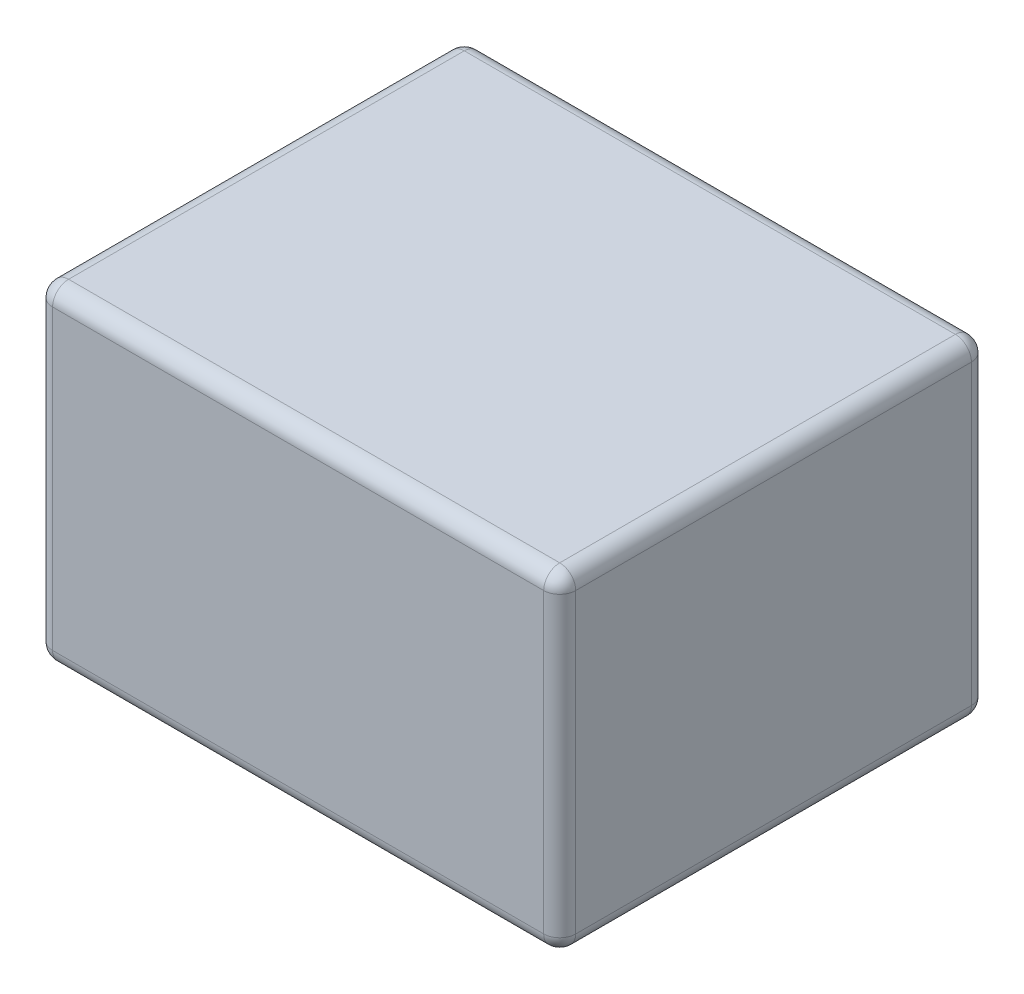
ISO-10303-21;
HEADER;
FILE_DESCRIPTION(('STEP AP214'),'2;1');
FILE_NAME('part.step','',(''),(''),'','','');
FILE_SCHEMA(('AUTOMOTIVE_DESIGN { 1 0 10303 214 1 1 1 1 }'));
ENDSEC;
DATA;
#1=APPLICATION_CONTEXT('core data for automotive mechanical design processes');
#2=APPLICATION_PROTOCOL_DEFINITION('international standard','automotive_design',2000,#1);
#3=PRODUCT_CONTEXT('',#1,'mechanical');
#4=PRODUCT('Part','Part','',(#3));
#5=PRODUCT_RELATED_PRODUCT_CATEGORY('part','',(#4));
#6=PRODUCT_DEFINITION_FORMATION('','',#4);
#7=PRODUCT_DEFINITION_CONTEXT('part definition',#1,'design');
#8=PRODUCT_DEFINITION('design','',#6,#7);
#9=PRODUCT_DEFINITION_SHAPE('','',#8);
#10=(LENGTH_UNIT() NAMED_UNIT(*) SI_UNIT(.MILLI.,.METRE.));
#11=(NAMED_UNIT(*) PLANE_ANGLE_UNIT() SI_UNIT($,.RADIAN.));
#12=(NAMED_UNIT(*) SI_UNIT($,.STERADIAN.) SOLID_ANGLE_UNIT());
#13=UNCERTAINTY_MEASURE_WITH_UNIT(LENGTH_MEASURE(1.E-05),#10,'distance_accuracy_value','');
#14=(GEOMETRIC_REPRESENTATION_CONTEXT(3) GLOBAL_UNCERTAINTY_ASSIGNED_CONTEXT((#13)) GLOBAL_UNIT_ASSIGNED_CONTEXT((#10,
#11,#12)) REPRESENTATION_CONTEXT('',''));
#15=CARTESIAN_POINT('',(0.,0.,0.));
#16=DIRECTION('',(0.,0.,1.));
#17=DIRECTION('',(1.,0.,0.));
#18=AXIS2_PLACEMENT_3D('',#15,#16,#17);
#19=CARTESIAN_POINT('',(-95.9094761980636,12.7331197579881,44.1688603023946));
#20=DIRECTION('',(0.,1.,0.));
#21=DIRECTION('',(0.,0.,-1.));
#22=AXIS2_PLACEMENT_3D('',#19,#20,#21);
#23=CYLINDRICAL_SURFACE('',#22,0.101);
#24=CARTESIAN_POINT('',(-95.9094761980636,12.6321197579881,44.1688603023946));
#25=DIRECTION('',(0.,-1.,0.));
#26=DIRECTION('',(0.,0.,1.));
#27=AXIS2_PLACEMENT_3D('',#24,#25,#26);
#28=CIRCLE('',#27,0.101);
#29=CARTESIAN_POINT('',(-95.8084761980636,12.6321197579881,44.1688603023946));
#30=VERTEX_POINT('',#29);
#31=CARTESIAN_POINT('',(-95.9094761980636,12.6321197579881,44.2698603023946));
#32=VERTEX_POINT('',#31);
#33=EDGE_CURVE('E25',#30,#32,#28,.T.);
#34=ORIENTED_EDGE('',*,*,#33,.T.);
#35=DIRECTION('',(0.,1.,0.));
#36=VECTOR('',#35,1.);
#37=CARTESIAN_POINT('',(-95.9094761980636,12.7331197579881,44.2698603023946));
#38=LINE('',#37,#36);
#39=CARTESIAN_POINT('',(-95.9094761980636,10.7561197579881,44.2698603023946));
#40=VERTEX_POINT('',#39);
#41=EDGE_CURVE('E306',#40,#32,#38,.T.);
#42=ORIENTED_EDGE('',*,*,#41,.F.);
#43=CARTESIAN_POINT('',(-95.9094761980636,10.7561197579881,44.1688603023946));
#44=DIRECTION('',(0.,1.,0.));
#45=DIRECTION('',(0.,0.,-1.));
#46=AXIS2_PLACEMENT_3D('',#43,#44,#45);
#47=CIRCLE('',#46,0.101);
#48=CARTESIAN_POINT('',(-95.8084761980636,10.7561197579881,44.1688603023946));
#49=VERTEX_POINT('',#48);
#50=EDGE_CURVE('E11',#40,#49,#47,.T.);
#51=ORIENTED_EDGE('',*,*,#50,.T.);
#52=DIRECTION('',(0.,-1.,0.));
#53=VECTOR('',#52,1.);
#54=CARTESIAN_POINT('',(-95.8084761980636,12.7331197579881,44.1688603023946));
#55=LINE('',#54,#53);
#56=EDGE_CURVE('E199',#30,#49,#55,.T.);
#57=ORIENTED_EDGE('',*,*,#56,.F.);
#58=EDGE_LOOP('',(#34,#42,#51,#57));
#59=FACE_BOUND('',#58,.T.);
#60=ADVANCED_FACE('F17',(#59),#23,.T.);
#61=CARTESIAN_POINT('',(-95.9094761980636,10.7561197579881,44.1688603023946));
#62=DIRECTION('',(0.,1.,0.));
#63=DIRECTION('',(1.,0.,0.));
#64=AXIS2_PLACEMENT_3D('',#61,#62,#63);
#65=SPHERICAL_SURFACE('',#64,0.101);
#66=CARTESIAN_POINT('',(-95.9094761980636,10.7561197579881,44.1688603023946));
#67=DIRECTION('',(1.,0.,0.));
#68=DIRECTION('',(0.,0.,-1.));
#69=AXIS2_PLACEMENT_3D('',#66,#67,#68);
#70=CIRCLE('',#69,0.101);
#71=CARTESIAN_POINT('',(-95.9094761980636,10.6551197579881,44.1688603023946));
#72=VERTEX_POINT('',#71);
#73=EDGE_CURVE('E297',#40,#72,#70,.T.);
#74=ORIENTED_EDGE('',*,*,#73,.T.);
#75=CARTESIAN_POINT('',(-95.9094761980636,10.7561197579881,44.1688603023946));
#76=DIRECTION('',(0.,0.,1.));
#77=DIRECTION('',(1.,0.,0.));
#78=AXIS2_PLACEMENT_3D('',#75,#76,#77);
#79=CIRCLE('',#78,0.101);
#80=EDGE_CURVE('E293',#72,#49,#79,.T.);
#81=ORIENTED_EDGE('',*,*,#80,.T.);
#82=ORIENTED_EDGE('',*,*,#50,.F.);
#83=EDGE_LOOP('',(#74,#81,#82));
#84=FACE_BOUND('',#83,.T.);
#85=ADVANCED_FACE('F400',(#84),#65,.T.);
#86=CARTESIAN_POINT('',(-95.9094761980636,12.6321197579881,44.1688603023946));
#87=DIRECTION('',(0.,1.,0.));
#88=DIRECTION('',(1.,0.,0.));
#89=AXIS2_PLACEMENT_3D('',#86,#87,#88);
#90=SPHERICAL_SURFACE('',#89,0.101);
#91=CARTESIAN_POINT('',(-95.9094761980636,12.6321197579881,44.1688603023946));
#92=DIRECTION('',(0.,0.,1.));
#93=DIRECTION('',(1.,0.,0.));
#94=AXIS2_PLACEMENT_3D('',#91,#92,#93);
#95=CIRCLE('',#94,0.101);
#96=CARTESIAN_POINT('',(-95.9094761980636,12.7331197579881,44.1688603023946));
#97=VERTEX_POINT('',#96);
#98=EDGE_CURVE('E290',#30,#97,#95,.T.);
#99=ORIENTED_EDGE('',*,*,#98,.T.);
#100=CARTESIAN_POINT('',(-95.9094761980636,12.6321197579881,44.1688603023946));
#101=DIRECTION('',(1.,0.,0.));
#102=DIRECTION('',(0.,0.,-1.));
#103=AXIS2_PLACEMENT_3D('',#100,#101,#102);
#104=CIRCLE('',#103,0.101);
#105=EDGE_CURVE('E202',#97,#32,#104,.T.);
#106=ORIENTED_EDGE('',*,*,#105,.T.);
#107=ORIENTED_EDGE('',*,*,#33,.F.);
#108=EDGE_LOOP('',(#99,#106,#107));
#109=FACE_BOUND('',#108,.T.);
#110=ADVANCED_FACE('F314',(#109),#90,.T.);
#111=CARTESIAN_POINT('',(-99.1084761980636,10.7561197579881,44.1688603023946));
#112=DIRECTION('',(-1.,0.,0.));
#113=DIRECTION('',(0.,0.,-1.));
#114=AXIS2_PLACEMENT_3D('',#111,#112,#113);
#115=CYLINDRICAL_SURFACE('',#114,0.101);
#116=CARTESIAN_POINT('',(-99.0074761980636,10.7561197579881,44.1688603023946));
#117=DIRECTION('',(1.,0.,0.));
#118=DIRECTION('',(0.,0.,1.));
#119=AXIS2_PLACEMENT_3D('',#116,#117,#118);
#120=CIRCLE('',#119,0.101);
#121=CARTESIAN_POINT('',(-99.0074761980636,10.7561197579881,44.2698603023946));
#122=VERTEX_POINT('',#121);
#123=CARTESIAN_POINT('',(-99.0074761980636,10.6551197579881,44.1688603023946));
#124=VERTEX_POINT('',#123);
#125=EDGE_CURVE('E49',#122,#124,#120,.T.);
#126=ORIENTED_EDGE('',*,*,#125,.T.);
#127=DIRECTION('',(-1.,0.,0.));
#128=VECTOR('',#127,1.);
#129=CARTESIAN_POINT('',(-99.1084761980636,10.6551197579881,44.1688603023946));
#130=LINE('',#129,#128);
#131=EDGE_CURVE('E240',#72,#124,#130,.T.);
#132=ORIENTED_EDGE('',*,*,#131,.F.);
#133=ORIENTED_EDGE('',*,*,#73,.F.);
#134=DIRECTION('',(1.,0.,0.));
#135=VECTOR('',#134,1.);
#136=CARTESIAN_POINT('',(-99.1084761980636,10.7561197579881,44.2698603023946));
#137=LINE('',#136,#135);
#138=EDGE_CURVE('E326',#122,#40,#137,.T.);
#139=ORIENTED_EDGE('',*,*,#138,.F.);
#140=EDGE_LOOP('',(#126,#132,#133,#139));
#141=FACE_BOUND('',#140,.T.);
#142=ADVANCED_FACE('F409',(#141),#115,.T.);
#143=CARTESIAN_POINT('',(-95.9094761980636,10.7561197579881,44.2698603023946));
#144=DIRECTION('',(0.,0.,1.));
#145=DIRECTION('',(-1.,0.,0.));
#146=AXIS2_PLACEMENT_3D('',#143,#144,#145);
#147=CYLINDRICAL_SURFACE('',#146,0.101);
#148=CARTESIAN_POINT('',(-95.9094761980636,10.7561197579881,41.6728603023946));
#149=DIRECTION('',(0.,0.,1.));
#150=DIRECTION('',(-1.,0.,0.));
#151=AXIS2_PLACEMENT_3D('',#148,#149,#150);
#152=CIRCLE('',#151,0.101);
#153=CARTESIAN_POINT('',(-95.9094761980636,10.6551197579881,41.6728603023946));
#154=VERTEX_POINT('',#153);
#155=CARTESIAN_POINT('',(-95.8084761980636,10.7561197579881,41.6728603023946));
#156=VERTEX_POINT('',#155);
#157=EDGE_CURVE('E203',#154,#156,#152,.T.);
#158=ORIENTED_EDGE('',*,*,#157,.T.);
#159=DIRECTION('',(0.,0.,-1.));
#160=VECTOR('',#159,1.);
#161=CARTESIAN_POINT('',(-95.8084761980636,10.7561197579881,44.2698603023946));
#162=LINE('',#161,#160);
#163=EDGE_CURVE('E195',#49,#156,#162,.T.);
#164=ORIENTED_EDGE('',*,*,#163,.F.);
#165=ORIENTED_EDGE('',*,*,#80,.F.);
#166=DIRECTION('',(0.,0.,1.));
#167=VECTOR('',#166,1.);
#168=CARTESIAN_POINT('',(-95.9094761980636,10.6551197579881,44.2698603023946));
#169=LINE('',#168,#167);
#170=EDGE_CURVE('E236',#154,#72,#169,.T.);
#171=ORIENTED_EDGE('',*,*,#170,.F.);
#172=EDGE_LOOP('',(#158,#164,#165,#171));
#173=FACE_BOUND('',#172,.T.);
#174=ADVANCED_FACE('F360',(#173),#147,.T.);
#175=CARTESIAN_POINT('',(-95.9094761980636,12.6321197579881,44.2698603023946));
#176=DIRECTION('',(0.,0.,-1.));
#177=DIRECTION('',(1.,0.,0.));
#178=AXIS2_PLACEMENT_3D('',#175,#176,#177);
#179=CYLINDRICAL_SURFACE('',#178,0.101);
#180=CARTESIAN_POINT('',(-95.9094761980636,12.6321197579881,41.6728603023946));
#181=DIRECTION('',(0.,0.,1.));
#182=DIRECTION('',(-1.,0.,0.));
#183=AXIS2_PLACEMENT_3D('',#180,#181,#182);
#184=CIRCLE('',#183,0.101);
#185=CARTESIAN_POINT('',(-95.8084761980636,12.6321197579881,41.6728603023946));
#186=VERTEX_POINT('',#185);
#187=CARTESIAN_POINT('',(-95.9094761980636,12.7331197579881,41.6728603023946));
#188=VERTEX_POINT('',#187);
#189=EDGE_CURVE('E284',#186,#188,#184,.T.);
#190=ORIENTED_EDGE('',*,*,#189,.T.);
#191=DIRECTION('',(0.,0.,-1.));
#192=VECTOR('',#191,1.);
#193=CARTESIAN_POINT('',(-95.9094761980636,12.7331197579881,41.5718603023946));
#194=LINE('',#193,#192);
#195=EDGE_CURVE('E211',#97,#188,#194,.T.);
#196=ORIENTED_EDGE('',*,*,#195,.F.);
#197=ORIENTED_EDGE('',*,*,#98,.F.);
#198=DIRECTION('',(0.,0.,1.));
#199=VECTOR('',#198,1.);
#200=CARTESIAN_POINT('',(-95.8084761980636,12.6321197579881,44.2698603023946));
#201=LINE('',#200,#199);
#202=EDGE_CURVE('E190',#186,#30,#201,.T.);
#203=ORIENTED_EDGE('',*,*,#202,.F.);
#204=EDGE_LOOP('',(#190,#196,#197,#203));
#205=FACE_BOUND('',#204,.T.);
#206=ADVANCED_FACE('F346',(#205),#179,.T.);
#207=CARTESIAN_POINT('',(-99.1084761980636,12.6321197579881,44.1688603023946));
#208=DIRECTION('',(1.,0.,0.));
#209=DIRECTION('',(0.,0.,1.));
#210=AXIS2_PLACEMENT_3D('',#207,#208,#209);
#211=CYLINDRICAL_SURFACE('',#210,0.101);
#212=CARTESIAN_POINT('',(-99.0074761980636,12.6321197579881,44.1688603023946));
#213=DIRECTION('',(1.,0.,0.));
#214=DIRECTION('',(0.,0.,1.));
#215=AXIS2_PLACEMENT_3D('',#212,#213,#214);
#216=CIRCLE('',#215,0.101);
#217=CARTESIAN_POINT('',(-99.0074761980636,12.7331197579881,44.1688603023946));
#218=VERTEX_POINT('',#217);
#219=CARTESIAN_POINT('',(-99.0074761980636,12.6321197579881,44.2698603023946));
#220=VERTEX_POINT('',#219);
#221=EDGE_CURVE('E226',#218,#220,#216,.T.);
#222=ORIENTED_EDGE('',*,*,#221,.T.);
#223=DIRECTION('',(-1.,0.,0.));
#224=VECTOR('',#223,1.);
#225=CARTESIAN_POINT('',(-99.1084761980636,12.6321197579881,44.2698603023946));
#226=LINE('',#225,#224);
#227=EDGE_CURVE('E319',#32,#220,#226,.T.);
#228=ORIENTED_EDGE('',*,*,#227,.F.);
#229=ORIENTED_EDGE('',*,*,#105,.F.);
#230=DIRECTION('',(1.,0.,0.));
#231=VECTOR('',#230,1.);
#232=CARTESIAN_POINT('',(-95.8084761980636,12.7331197579881,44.1688603023946));
#233=LINE('',#232,#231);
#234=EDGE_CURVE('E207',#218,#97,#233,.T.);
#235=ORIENTED_EDGE('',*,*,#234,.F.);
#236=EDGE_LOOP('',(#222,#228,#229,#235));
#237=FACE_BOUND('',#236,.T.);
#238=ADVANCED_FACE('F320',(#237),#211,.T.);
#239=CARTESIAN_POINT('',(-99.0074761980636,10.7561197579881,44.1688603023946));
#240=DIRECTION('',(0.,1.,0.));
#241=DIRECTION('',(1.,0.,0.));
#242=AXIS2_PLACEMENT_3D('',#239,#240,#241);
#243=SPHERICAL_SURFACE('',#242,0.101);
#244=CARTESIAN_POINT('',(-99.0074761980636,10.7561197579881,44.1688603023946));
#245=DIRECTION('',(0.,-1.,0.));
#246=DIRECTION('',(1.,0.,0.));
#247=AXIS2_PLACEMENT_3D('',#244,#245,#246);
#248=CIRCLE('',#247,0.101);
#249=CARTESIAN_POINT('',(-99.1084761980636,10.7561197579881,44.1688603023946));
#250=VERTEX_POINT('',#249);
#251=EDGE_CURVE('E223',#122,#250,#248,.T.);
#252=ORIENTED_EDGE('',*,*,#251,.T.);
#253=CARTESIAN_POINT('',(-99.0074761980636,10.7561197579881,44.1688603023946));
#254=DIRECTION('',(0.,0.,1.));
#255=DIRECTION('',(1.,0.,0.));
#256=AXIS2_PLACEMENT_3D('',#253,#254,#255);
#257=CIRCLE('',#256,0.101);
#258=EDGE_CURVE('E248',#250,#124,#257,.T.);
#259=ORIENTED_EDGE('',*,*,#258,.T.);
#260=ORIENTED_EDGE('',*,*,#125,.F.);
#261=EDGE_LOOP('',(#252,#259,#260));
#262=FACE_BOUND('',#261,.T.);
#263=ADVANCED_FACE('F418',(#262),#243,.T.);
#264=CARTESIAN_POINT('',(-95.9094761980636,10.7561197579881,41.6728603023946));
#265=DIRECTION('',(0.,1.,0.));
#266=DIRECTION('',(1.,0.,0.));
#267=AXIS2_PLACEMENT_3D('',#264,#265,#266);
#268=SPHERICAL_SURFACE('',#267,0.101);
#269=CARTESIAN_POINT('',(-95.9094761980636,10.7561197579881,41.6728603023946));
#270=DIRECTION('',(1.,0.,0.));
#271=DIRECTION('',(0.,0.,-1.));
#272=AXIS2_PLACEMENT_3D('',#269,#270,#271);
#273=CIRCLE('',#272,0.101);
#274=CARTESIAN_POINT('',(-95.9094761980636,10.7561197579881,41.5718603023946));
#275=VERTEX_POINT('',#274);
#276=EDGE_CURVE('E245',#154,#275,#273,.T.);
#277=ORIENTED_EDGE('',*,*,#276,.T.);
#278=CARTESIAN_POINT('',(-95.9094761980636,10.7561197579881,41.6728603023946));
#279=DIRECTION('',(0.,-1.,0.));
#280=DIRECTION('',(1.,0.,0.));
#281=AXIS2_PLACEMENT_3D('',#278,#279,#280);
#282=CIRCLE('',#281,0.101);
#283=EDGE_CURVE('E271',#275,#156,#282,.T.);
#284=ORIENTED_EDGE('',*,*,#283,.T.);
#285=ORIENTED_EDGE('',*,*,#157,.F.);
#286=EDGE_LOOP('',(#277,#284,#285));
#287=FACE_BOUND('',#286,.T.);
#288=ADVANCED_FACE('F366',(#287),#268,.T.);
#289=CARTESIAN_POINT('',(-95.9094761980636,12.6321197579881,41.6728603023946));
#290=DIRECTION('',(0.,1.,0.));
#291=DIRECTION('',(1.,0.,0.));
#292=AXIS2_PLACEMENT_3D('',#289,#290,#291);
#293=SPHERICAL_SURFACE('',#292,0.101);
#294=CARTESIAN_POINT('',(-95.9094761980636,12.6321197579881,41.6728603023946));
#295=DIRECTION('',(0.,1.,0.));
#296=DIRECTION('',(0.,0.,1.));
#297=AXIS2_PLACEMENT_3D('',#294,#295,#296);
#298=CIRCLE('',#297,0.101);
#299=CARTESIAN_POINT('',(-95.9094761980636,12.6321197579881,41.5718603023946));
#300=VERTEX_POINT('',#299);
#301=EDGE_CURVE('E249',#186,#300,#298,.T.);
#302=ORIENTED_EDGE('',*,*,#301,.T.);
#303=CARTESIAN_POINT('',(-95.9094761980636,12.6321197579881,41.6728603023946));
#304=DIRECTION('',(1.,0.,0.));
#305=DIRECTION('',(0.,0.,-1.));
#306=AXIS2_PLACEMENT_3D('',#303,#304,#305);
#307=CIRCLE('',#306,0.101);
#308=EDGE_CURVE('E170',#300,#188,#307,.T.);
#309=ORIENTED_EDGE('',*,*,#308,.T.);
#310=ORIENTED_EDGE('',*,*,#189,.F.);
#311=EDGE_LOOP('',(#302,#309,#310));
#312=FACE_BOUND('',#311,.T.);
#313=ADVANCED_FACE('F350',(#312),#293,.T.);
#314=CARTESIAN_POINT('',(-99.0074761980636,12.6321197579881,44.1688603023946));
#315=DIRECTION('',(0.,1.,0.));
#316=DIRECTION('',(1.,0.,0.));
#317=AXIS2_PLACEMENT_3D('',#314,#315,#316);
#318=SPHERICAL_SURFACE('',#317,0.101);
#319=CARTESIAN_POINT('',(-99.0074761980636,12.6321197579881,44.1688603023946));
#320=DIRECTION('',(0.,0.,1.));
#321=DIRECTION('',(1.,0.,0.));
#322=AXIS2_PLACEMENT_3D('',#319,#320,#321);
#323=CIRCLE('',#322,0.101);
#324=CARTESIAN_POINT('',(-99.1084761980636,12.6321197579881,44.1688603023946));
#325=VERTEX_POINT('',#324);
#326=EDGE_CURVE('E255',#218,#325,#323,.T.);
#327=ORIENTED_EDGE('',*,*,#326,.T.);
#328=CARTESIAN_POINT('',(-99.0074761980636,12.6321197579881,44.1688603023946));
#329=DIRECTION('',(0.,1.,0.));
#330=DIRECTION('',(0.,0.,1.));
#331=AXIS2_PLACEMENT_3D('',#328,#329,#330);
#332=CIRCLE('',#331,0.101);
#333=EDGE_CURVE('E227',#325,#220,#332,.T.);
#334=ORIENTED_EDGE('',*,*,#333,.T.);
#335=ORIENTED_EDGE('',*,*,#221,.F.);
#336=EDGE_LOOP('',(#327,#334,#335));
#337=FACE_BOUND('',#336,.T.);
#338=ADVANCED_FACE('F386',(#337),#318,.T.);
#339=CARTESIAN_POINT('',(-99.0074761980636,12.7331197579881,44.1688603023946));
#340=DIRECTION('',(0.,-1.,0.));
#341=DIRECTION('',(0.,0.,1.));
#342=AXIS2_PLACEMENT_3D('',#339,#340,#341);
#343=CYLINDRICAL_SURFACE('',#342,0.101);
#344=ORIENTED_EDGE('',*,*,#333,.F.);
#345=DIRECTION('',(0.,1.,0.));
#346=VECTOR('',#345,1.);
#347=CARTESIAN_POINT('',(-99.1084761980636,12.7331197579881,44.1688603023946));
#348=LINE('',#347,#346);
#349=EDGE_CURVE('E216',#250,#325,#348,.T.);
#350=ORIENTED_EDGE('',*,*,#349,.F.);
#351=ORIENTED_EDGE('',*,*,#251,.F.);
#352=DIRECTION('',(0.,-1.,0.));
#353=VECTOR('',#352,1.);
#354=CARTESIAN_POINT('',(-99.0074761980636,10.6551197579881,44.2698603023946));
#355=LINE('',#354,#353);
#356=EDGE_CURVE('E332',#220,#122,#355,.T.);
#357=ORIENTED_EDGE('',*,*,#356,.F.);
#358=EDGE_LOOP('',(#344,#350,#351,#357));
#359=FACE_BOUND('',#358,.T.);
#360=ADVANCED_FACE('F383',(#359),#343,.T.);
#361=CARTESIAN_POINT('',(-99.0074761980636,10.7561197579881,44.2698603023946));
#362=DIRECTION('',(0.,0.,-1.));
#363=DIRECTION('',(1.,0.,0.));
#364=AXIS2_PLACEMENT_3D('',#361,#362,#363);
#365=CYLINDRICAL_SURFACE('',#364,0.101);
#366=CARTESIAN_POINT('',(-99.0074761980636,10.7561197579881,41.6728603023946));
#367=DIRECTION('',(0.,0.,1.));
#368=DIRECTION('',(-1.,0.,0.));
#369=AXIS2_PLACEMENT_3D('',#366,#367,#368);
#370=CIRCLE('',#369,0.101);
#371=CARTESIAN_POINT('',(-99.1084761980636,10.7561197579881,41.6728603023946));
#372=VERTEX_POINT('',#371);
#373=CARTESIAN_POINT('',(-99.0074761980636,10.6551197579881,41.6728603023946));
#374=VERTEX_POINT('',#373);
#375=EDGE_CURVE('E264',#372,#374,#370,.T.);
#376=ORIENTED_EDGE('',*,*,#375,.T.);
#377=DIRECTION('',(0.,0.,-1.));
#378=VECTOR('',#377,1.);
#379=CARTESIAN_POINT('',(-99.0074761980636,10.6551197579881,41.5718603023946));
#380=LINE('',#379,#378);
#381=EDGE_CURVE('E244',#124,#374,#380,.T.);
#382=ORIENTED_EDGE('',*,*,#381,.F.);
#383=ORIENTED_EDGE('',*,*,#258,.F.);
#384=DIRECTION('',(0.,0.,1.));
#385=VECTOR('',#384,1.);
#386=CARTESIAN_POINT('',(-99.1084761980636,10.7561197579881,44.2698603023946));
#387=LINE('',#386,#385);
#388=EDGE_CURVE('E175',#372,#250,#387,.T.);
#389=ORIENTED_EDGE('',*,*,#388,.F.);
#390=EDGE_LOOP('',(#376,#382,#383,#389));
#391=FACE_BOUND('',#390,.T.);
#392=ADVANCED_FACE('F377',(#391),#365,.T.);
#393=CARTESIAN_POINT('',(-99.1084761980636,10.7561197579881,41.6728603023946));
#394=DIRECTION('',(1.,0.,0.));
#395=DIRECTION('',(0.,0.,1.));
#396=AXIS2_PLACEMENT_3D('',#393,#394,#395);
#397=CYLINDRICAL_SURFACE('',#396,0.101);
#398=CARTESIAN_POINT('',(-99.0074761980636,10.7561197579881,41.6728603023946));
#399=DIRECTION('',(1.,0.,0.));
#400=DIRECTION('',(0.,0.,1.));
#401=AXIS2_PLACEMENT_3D('',#398,#399,#400);
#402=CIRCLE('',#401,0.101);
#403=CARTESIAN_POINT('',(-99.0074761980636,10.7561197579881,41.5718603023946));
#404=VERTEX_POINT('',#403);
#405=EDGE_CURVE('E38',#374,#404,#402,.T.);
#406=ORIENTED_EDGE('',*,*,#405,.T.);
#407=DIRECTION('',(-1.,0.,0.));
#408=VECTOR('',#407,1.);
#409=CARTESIAN_POINT('',(-99.1084761980636,10.7561197579881,41.5718603023946));
#410=LINE('',#409,#408);
#411=EDGE_CURVE('E179',#275,#404,#410,.T.);
#412=ORIENTED_EDGE('',*,*,#411,.F.);
#413=ORIENTED_EDGE('',*,*,#276,.F.);
#414=DIRECTION('',(1.,0.,0.));
#415=VECTOR('',#414,1.);
#416=CARTESIAN_POINT('',(-95.8084761980636,10.6551197579881,41.6728603023946));
#417=LINE('',#416,#415);
#418=EDGE_CURVE('E163',#374,#154,#417,.T.);
#419=ORIENTED_EDGE('',*,*,#418,.F.);
#420=EDGE_LOOP('',(#406,#412,#413,#419));
#421=FACE_BOUND('',#420,.T.);
#422=ADVANCED_FACE('F368',(#421),#397,.T.);
#423=CARTESIAN_POINT('',(-95.9094761980636,12.7331197579881,41.6728603023946));
#424=DIRECTION('',(0.,-1.,0.));
#425=DIRECTION('',(0.,0.,1.));
#426=AXIS2_PLACEMENT_3D('',#423,#424,#425);
#427=CYLINDRICAL_SURFACE('',#426,0.101);
#428=ORIENTED_EDGE('',*,*,#283,.F.);
#429=DIRECTION('',(0.,-1.,0.));
#430=VECTOR('',#429,1.);
#431=CARTESIAN_POINT('',(-95.9094761980636,10.6551197579881,41.5718603023946));
#432=LINE('',#431,#430);
#433=EDGE_CURVE('E186',#300,#275,#432,.T.);
#434=ORIENTED_EDGE('',*,*,#433,.F.);
#435=ORIENTED_EDGE('',*,*,#301,.F.);
#436=DIRECTION('',(0.,1.,0.));
#437=VECTOR('',#436,1.);
#438=CARTESIAN_POINT('',(-95.8084761980636,12.7331197579881,41.6728603023946));
#439=LINE('',#438,#437);
#440=EDGE_CURVE('E194',#156,#186,#439,.T.);
#441=ORIENTED_EDGE('',*,*,#440,.F.);
#442=EDGE_LOOP('',(#428,#434,#435,#441));
#443=FACE_BOUND('',#442,.T.);
#444=ADVANCED_FACE('F354',(#443),#427,.T.);
#445=CARTESIAN_POINT('',(-99.1084761980636,12.6321197579881,41.6728603023946));
#446=DIRECTION('',(-1.,0.,0.));
#447=DIRECTION('',(0.,0.,-1.));
#448=AXIS2_PLACEMENT_3D('',#445,#446,#447);
#449=CYLINDRICAL_SURFACE('',#448,0.101);
#450=CARTESIAN_POINT('',(-99.0074761980636,12.6321197579881,41.6728603023946));
#451=DIRECTION('',(1.,0.,0.));
#452=DIRECTION('',(0.,0.,1.));
#453=AXIS2_PLACEMENT_3D('',#450,#451,#452);
#454=CIRCLE('',#453,0.101);
#455=CARTESIAN_POINT('',(-99.0074761980636,12.6321197579881,41.5718603023946));
#456=VERTEX_POINT('',#455);
#457=CARTESIAN_POINT('',(-99.0074761980636,12.7331197579881,41.6728603023946));
#458=VERTEX_POINT('',#457);
#459=EDGE_CURVE('E139',#456,#458,#454,.T.);
#460=ORIENTED_EDGE('',*,*,#459,.T.);
#461=DIRECTION('',(-1.,0.,0.));
#462=VECTOR('',#461,1.);
#463=CARTESIAN_POINT('',(-99.1084761980636,12.7331197579881,41.6728603023946));
#464=LINE('',#463,#462);
#465=EDGE_CURVE('E233',#188,#458,#464,.T.);
#466=ORIENTED_EDGE('',*,*,#465,.F.);
#467=ORIENTED_EDGE('',*,*,#308,.F.);
#468=DIRECTION('',(1.,0.,0.));
#469=VECTOR('',#468,1.);
#470=CARTESIAN_POINT('',(-99.1084761980636,12.6321197579881,41.5718603023946));
#471=LINE('',#470,#469);
#472=EDGE_CURVE('E167',#456,#300,#471,.T.);
#473=ORIENTED_EDGE('',*,*,#472,.F.);
#474=EDGE_LOOP('',(#460,#466,#467,#473));
#475=FACE_BOUND('',#474,.T.);
#476=ADVANCED_FACE('F168',(#475),#449,.T.);
#477=CARTESIAN_POINT('',(-99.0074761980636,12.6321197579881,44.2698603023946));
#478=DIRECTION('',(0.,0.,1.));
#479=DIRECTION('',(-1.,0.,0.));
#480=AXIS2_PLACEMENT_3D('',#477,#478,#479);
#481=CYLINDRICAL_SURFACE('',#480,0.101);
#482=CARTESIAN_POINT('',(-99.0074761980636,12.6321197579881,41.6728603023946));
#483=DIRECTION('',(0.,0.,1.));
#484=DIRECTION('',(-1.,0.,0.));
#485=AXIS2_PLACEMENT_3D('',#482,#483,#484);
#486=CIRCLE('',#485,0.101);
#487=CARTESIAN_POINT('',(-99.1084761980636,12.6321197579881,41.6728603023946));
#488=VERTEX_POINT('',#487);
#489=EDGE_CURVE('E144',#458,#488,#486,.T.);
#490=ORIENTED_EDGE('',*,*,#489,.T.);
#491=DIRECTION('',(0.,0.,-1.));
#492=VECTOR('',#491,1.);
#493=CARTESIAN_POINT('',(-99.1084761980636,12.6321197579881,44.2698603023946));
#494=LINE('',#493,#492);
#495=EDGE_CURVE('E220',#325,#488,#494,.T.);
#496=ORIENTED_EDGE('',*,*,#495,.F.);
#497=ORIENTED_EDGE('',*,*,#326,.F.);
#498=DIRECTION('',(0.,0.,1.));
#499=VECTOR('',#498,1.);
#500=CARTESIAN_POINT('',(-99.0074761980636,12.7331197579881,44.2698603023946));
#501=LINE('',#500,#499);
#502=EDGE_CURVE('E212',#458,#218,#501,.T.);
#503=ORIENTED_EDGE('',*,*,#502,.F.);
#504=EDGE_LOOP('',(#490,#496,#497,#503));
#505=FACE_BOUND('',#504,.T.);
#506=ADVANCED_FACE('F388',(#505),#481,.T.);
#507=CARTESIAN_POINT('',(-99.0074761980636,10.7561197579881,41.6728603023946));
#508=DIRECTION('',(0.,1.,0.));
#509=DIRECTION('',(1.,0.,0.));
#510=AXIS2_PLACEMENT_3D('',#507,#508,#509);
#511=SPHERICAL_SURFACE('',#510,0.101);
#512=ORIENTED_EDGE('',*,*,#375,.F.);
#513=CARTESIAN_POINT('',(-99.0074761980636,10.7561197579881,41.6728603023946));
#514=DIRECTION('',(0.,-1.,0.));
#515=DIRECTION('',(0.,0.,-1.));
#516=AXIS2_PLACEMENT_3D('',#513,#514,#515);
#517=CIRCLE('',#516,0.101);
#518=EDGE_CURVE('E150',#372,#404,#517,.T.);
#519=ORIENTED_EDGE('',*,*,#518,.T.);
#520=ORIENTED_EDGE('',*,*,#405,.F.);
#521=EDGE_LOOP('',(#512,#519,#520));
#522=FACE_BOUND('',#521,.T.);
#523=ADVANCED_FACE('F370',(#522),#511,.T.);
#524=CARTESIAN_POINT('',(-99.0074761980636,12.6321197579881,41.6728603023946));
#525=DIRECTION('',(0.,1.,0.));
#526=DIRECTION('',(1.,0.,0.));
#527=AXIS2_PLACEMENT_3D('',#524,#525,#526);
#528=SPHERICAL_SURFACE('',#527,0.101);
#529=ORIENTED_EDGE('',*,*,#459,.F.);
#530=CARTESIAN_POINT('',(-99.0074761980636,12.6321197579881,41.6728603023946));
#531=DIRECTION('',(0.,1.,0.));
#532=DIRECTION('',(0.,0.,1.));
#533=AXIS2_PLACEMENT_3D('',#530,#531,#532);
#534=CIRCLE('',#533,0.101);
#535=EDGE_CURVE('E142',#456,#488,#534,.T.);
#536=ORIENTED_EDGE('',*,*,#535,.T.);
#537=ORIENTED_EDGE('',*,*,#489,.F.);
#538=EDGE_LOOP('',(#529,#536,#537));
#539=FACE_BOUND('',#538,.T.);
#540=ADVANCED_FACE('F141',(#539),#528,.T.);
#541=CARTESIAN_POINT('',(-99.0074761980636,12.7331197579881,41.6728603023946));
#542=DIRECTION('',(0.,1.,0.));
#543=DIRECTION('',(0.,0.,-1.));
#544=AXIS2_PLACEMENT_3D('',#541,#542,#543);
#545=CYLINDRICAL_SURFACE('',#544,0.101);
#546=ORIENTED_EDGE('',*,*,#535,.F.);
#547=DIRECTION('',(0.,1.,0.));
#548=VECTOR('',#547,1.);
#549=CARTESIAN_POINT('',(-99.0074761980636,12.7331197579881,41.5718603023946));
#550=LINE('',#549,#548);
#551=EDGE_CURVE('E157',#404,#456,#550,.T.);
#552=ORIENTED_EDGE('',*,*,#551,.F.);
#553=ORIENTED_EDGE('',*,*,#518,.F.);
#554=DIRECTION('',(0.,-1.,0.));
#555=VECTOR('',#554,1.);
#556=CARTESIAN_POINT('',(-99.1084761980636,12.7331197579881,41.6728603023946));
#557=LINE('',#556,#555);
#558=EDGE_CURVE('E160',#488,#372,#557,.T.);
#559=ORIENTED_EDGE('',*,*,#558,.F.);
#560=EDGE_LOOP('',(#546,#552,#553,#559));
#561=FACE_BOUND('',#560,.T.);
#562=ADVANCED_FACE('F154',(#561),#545,.T.);
#563=CARTESIAN_POINT('',(-99.1084761980636,10.6551197579881,44.2698603023946));
#564=DIRECTION('',(0.,1.,0.));
#565=DIRECTION('',(1.,0.,0.));
#566=AXIS2_PLACEMENT_3D('',#563,#564,#565);
#567=PLANE('',#566);
#568=ORIENTED_EDGE('',*,*,#170,.T.);
#569=ORIENTED_EDGE('',*,*,#131,.T.);
#570=ORIENTED_EDGE('',*,*,#381,.T.);
#571=ORIENTED_EDGE('',*,*,#418,.T.);
#572=EDGE_LOOP('',(#568,#569,#570,#571));
#573=FACE_BOUND('',#572,.T.);
#574=ADVANCED_FACE('F437',(#573),#567,.F.);
#575=CARTESIAN_POINT('',(-99.1084761980636,12.7331197579881,44.2698603023946));
#576=DIRECTION('',(0.,1.,0.));
#577=DIRECTION('',(1.,0.,0.));
#578=AXIS2_PLACEMENT_3D('',#575,#576,#577);
#579=PLANE('',#578);
#580=ORIENTED_EDGE('',*,*,#502,.T.);
#581=ORIENTED_EDGE('',*,*,#234,.T.);
#582=ORIENTED_EDGE('',*,*,#195,.T.);
#583=ORIENTED_EDGE('',*,*,#465,.T.);
#584=EDGE_LOOP('',(#580,#581,#582,#583));
#585=FACE_BOUND('',#584,.T.);
#586=ADVANCED_FACE('F343',(#585),#579,.T.);
#587=CARTESIAN_POINT('',(-99.1084761980636,12.7331197579881,44.2698603023946));
#588=DIRECTION('',(-1.,0.,0.));
#589=DIRECTION('',(0.,0.,1.));
#590=AXIS2_PLACEMENT_3D('',#587,#588,#589);
#591=PLANE('',#590);
#592=ORIENTED_EDGE('',*,*,#388,.T.);
#593=ORIENTED_EDGE('',*,*,#349,.T.);
#594=ORIENTED_EDGE('',*,*,#495,.T.);
#595=ORIENTED_EDGE('',*,*,#558,.T.);
#596=EDGE_LOOP('',(#592,#593,#594,#595));
#597=FACE_BOUND('',#596,.T.);
#598=ADVANCED_FACE('F373',(#597),#591,.T.);
#599=CARTESIAN_POINT('',(-99.1084761980636,12.7331197579881,41.5718603023946));
#600=DIRECTION('',(0.,0.,-1.));
#601=DIRECTION('',(0.,-1.,0.));
#602=AXIS2_PLACEMENT_3D('',#599,#600,#601);
#603=PLANE('',#602);
#604=ORIENTED_EDGE('',*,*,#433,.T.);
#605=ORIENTED_EDGE('',*,*,#411,.T.);
#606=ORIENTED_EDGE('',*,*,#551,.T.);
#607=ORIENTED_EDGE('',*,*,#472,.T.);
#608=EDGE_LOOP('',(#604,#605,#606,#607));
#609=FACE_BOUND('',#608,.T.);
#610=ADVANCED_FACE('F177',(#609),#603,.T.);
#611=CARTESIAN_POINT('',(-95.8084761980636,12.7331197579881,44.2698603023946));
#612=DIRECTION('',(-1.,0.,0.));
#613=DIRECTION('',(0.,0.,1.));
#614=AXIS2_PLACEMENT_3D('',#611,#612,#613);
#615=PLANE('',#614);
#616=ORIENTED_EDGE('',*,*,#202,.T.);
#617=ORIENTED_EDGE('',*,*,#56,.T.);
#618=ORIENTED_EDGE('',*,*,#163,.T.);
#619=ORIENTED_EDGE('',*,*,#440,.T.);
#620=EDGE_LOOP('',(#616,#617,#618,#619));
#621=FACE_BOUND('',#620,.T.);
#622=ADVANCED_FACE('F356',(#621),#615,.F.);
#623=CARTESIAN_POINT('',(-99.1084761980636,12.7331197579881,44.2698603023946));
#624=DIRECTION('',(0.,0.,-1.));
#625=DIRECTION('',(0.,-1.,0.));
#626=AXIS2_PLACEMENT_3D('',#623,#624,#625);
#627=PLANE('',#626);
#628=ORIENTED_EDGE('',*,*,#356,.T.);
#629=ORIENTED_EDGE('',*,*,#138,.T.);
#630=ORIENTED_EDGE('',*,*,#41,.T.);
#631=ORIENTED_EDGE('',*,*,#227,.T.);
#632=EDGE_LOOP('',(#628,#629,#630,#631));
#633=FACE_BOUND('',#632,.T.);
#634=ADVANCED_FACE('F325',(#633),#627,.F.);
#635=CLOSED_SHELL('',(#60,#85,#110,#142,#174,#206,#238,#263,#288,#313,#338,#360,#392,#422,#444,
#476,#506,#523,#540,#562,#574,#586,#598,#610,#622,#634));
#636=MANIFOLD_SOLID_BREP('B1',#635);
#637=ADVANCED_BREP_SHAPE_REPRESENTATION('',(#18,#636),#14);
#638=SHAPE_DEFINITION_REPRESENTATION(#9,#637);
ENDSEC;
END-ISO-10303-21;
